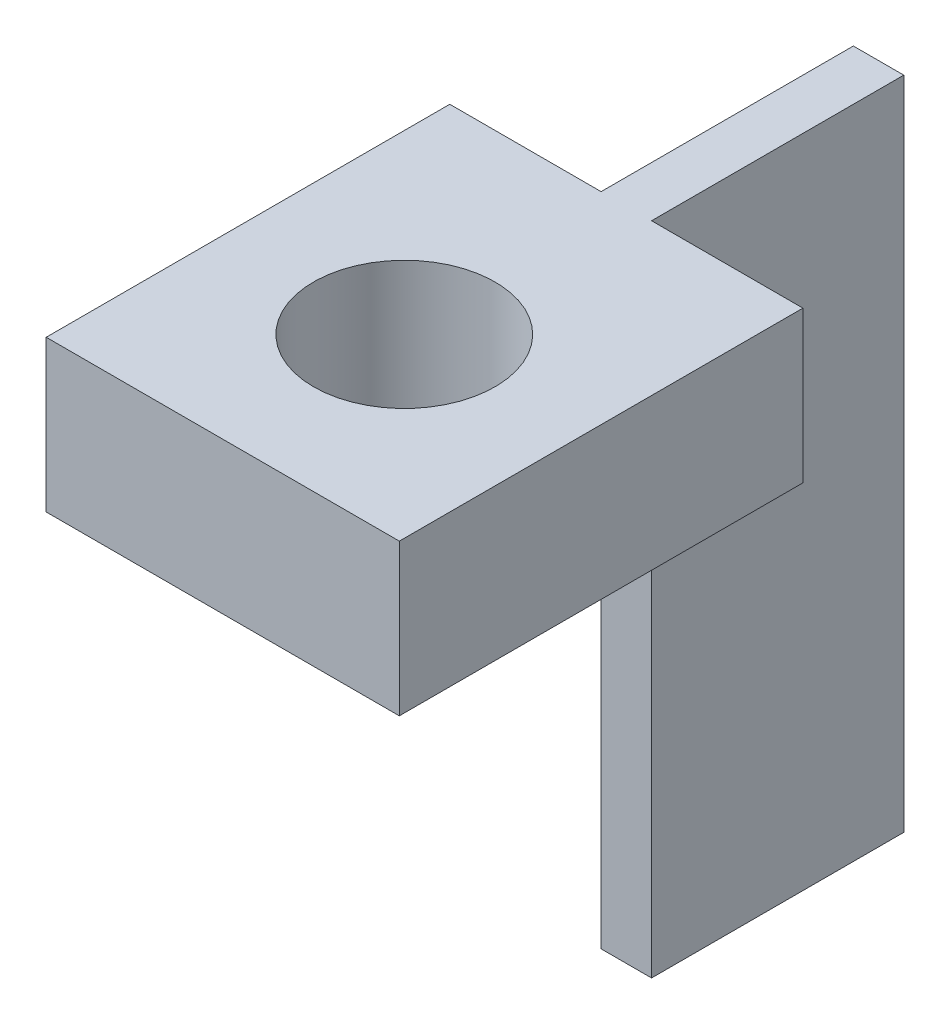
ISO-10303-21;
HEADER;
FILE_DESCRIPTION(('STEP AP214'),'2;1');
FILE_NAME('part.step','',(''),(''),'','','');
FILE_SCHEMA(('AUTOMOTIVE_DESIGN { 1 0 10303 214 1 1 1 1 }'));
ENDSEC;
DATA;
#1=APPLICATION_CONTEXT('core data for automotive mechanical design processes');
#2=APPLICATION_PROTOCOL_DEFINITION('international standard','automotive_design',2000,#1);
#3=PRODUCT_CONTEXT('',#1,'mechanical');
#4=PRODUCT('Part','Part','',(#3));
#5=PRODUCT_RELATED_PRODUCT_CATEGORY('part','',(#4));
#6=PRODUCT_DEFINITION_FORMATION('','',#4);
#7=PRODUCT_DEFINITION_CONTEXT('part definition',#1,'design');
#8=PRODUCT_DEFINITION('design','',#6,#7);
#9=PRODUCT_DEFINITION_SHAPE('','',#8);
#10=(LENGTH_UNIT() NAMED_UNIT(*) SI_UNIT(.MILLI.,.METRE.));
#11=(NAMED_UNIT(*) PLANE_ANGLE_UNIT() SI_UNIT($,.RADIAN.));
#12=(NAMED_UNIT(*) SI_UNIT($,.STERADIAN.) SOLID_ANGLE_UNIT());
#13=UNCERTAINTY_MEASURE_WITH_UNIT(LENGTH_MEASURE(1.E-05),#10,'distance_accuracy_value','');
#14=(GEOMETRIC_REPRESENTATION_CONTEXT(3) GLOBAL_UNCERTAINTY_ASSIGNED_CONTEXT((#13)) GLOBAL_UNIT_ASSIGNED_CONTEXT((#10,
#11,#12)) REPRESENTATION_CONTEXT('',''));
#15=CARTESIAN_POINT('',(0.,0.,0.));
#16=DIRECTION('',(0.,0.,1.));
#17=DIRECTION('',(1.,0.,0.));
#18=AXIS2_PLACEMENT_3D('',#15,#16,#17);
#19=CARTESIAN_POINT('',(0.5,0.,-5.));
#20=DIRECTION('',(0.,1.,0.));
#21=DIRECTION('',(0.,0.,1.));
#22=AXIS2_PLACEMENT_3D('',#19,#20,#21);
#23=PLANE('',#22);
#24=DIRECTION('',(0.,0.,-1.));
#25=VECTOR('',#24,1.);
#26=CARTESIAN_POINT('',(-0.5,0.,-5.));
#27=LINE('',#26,#25);
#28=CARTESIAN_POINT('',(-0.5,0.,0.));
#29=VERTEX_POINT('',#28);
#30=CARTESIAN_POINT('',(-0.5,0.,-5.));
#31=VERTEX_POINT('',#30);
#32=EDGE_CURVE('E160',#29,#31,#27,.T.);
#33=ORIENTED_EDGE('',*,*,#32,.T.);
#34=DIRECTION('',(-1.,0.,0.));
#35=VECTOR('',#34,1.);
#36=CARTESIAN_POINT('',(0.5,0.,-5.));
#37=LINE('',#36,#35);
#38=CARTESIAN_POINT('',(0.5,0.,-5.));
#39=VERTEX_POINT('',#38);
#40=EDGE_CURVE('E40',#39,#31,#37,.T.);
#41=ORIENTED_EDGE('',*,*,#40,.F.);
#42=DIRECTION('',(0.,0.,-1.));
#43=VECTOR('',#42,1.);
#44=CARTESIAN_POINT('',(0.5,0.,-5.));
#45=LINE('',#44,#43);
#46=CARTESIAN_POINT('',(0.5,0.,0.));
#47=VERTEX_POINT('',#46);
#48=EDGE_CURVE('E161',#47,#39,#45,.T.);
#49=ORIENTED_EDGE('',*,*,#48,.F.);
#50=DIRECTION('',(-1.,0.,0.));
#51=VECTOR('',#50,1.);
#52=CARTESIAN_POINT('',(0.5,0.,0.));
#53=LINE('',#52,#51);
#54=EDGE_CURVE('E166',#47,#29,#53,.T.);
#55=ORIENTED_EDGE('',*,*,#54,.T.);
#56=EDGE_LOOP('',(#33,#41,#49,#55));
#57=FACE_BOUND('',#56,.T.);
#58=ADVANCED_FACE('F33',(#57),#23,.F.);
#59=CARTESIAN_POINT('',(0.5,13.,-5.));
#60=DIRECTION('',(0.,0.,1.));
#61=DIRECTION('',(0.,-1.,0.));
#62=AXIS2_PLACEMENT_3D('',#59,#60,#61);
#63=PLANE('',#62);
#64=DIRECTION('',(0.,1.,0.));
#65=VECTOR('',#64,1.);
#66=CARTESIAN_POINT('',(-0.5,13.,-5.));
#67=LINE('',#66,#65);
#68=CARTESIAN_POINT('',(-0.5,13.,-5.));
#69=VERTEX_POINT('',#68);
#70=EDGE_CURVE('E169',#31,#69,#67,.T.);
#71=ORIENTED_EDGE('',*,*,#70,.T.);
#72=DIRECTION('',(-1.,0.,0.));
#73=VECTOR('',#72,1.);
#74=CARTESIAN_POINT('',(0.5,13.,-5.));
#75=LINE('',#74,#73);
#76=CARTESIAN_POINT('',(0.5,13.,-5.));
#77=VERTEX_POINT('',#76);
#78=EDGE_CURVE('E180',#77,#69,#75,.T.);
#79=ORIENTED_EDGE('',*,*,#78,.F.);
#80=DIRECTION('',(0.,1.,0.));
#81=VECTOR('',#80,1.);
#82=CARTESIAN_POINT('',(0.5,13.,-5.));
#83=LINE('',#82,#81);
#84=EDGE_CURVE('E80',#39,#77,#83,.T.);
#85=ORIENTED_EDGE('',*,*,#84,.F.);
#86=ORIENTED_EDGE('',*,*,#40,.T.);
#87=EDGE_LOOP('',(#71,#79,#85,#86));
#88=FACE_BOUND('',#87,.T.);
#89=ADVANCED_FACE('F182',(#88),#63,.F.);
#90=CARTESIAN_POINT('',(0.5,13.,8.));
#91=DIRECTION('',(0.,-1.,0.));
#92=DIRECTION('',(0.,0.,-1.));
#93=AXIS2_PLACEMENT_3D('',#90,#91,#92);
#94=PLANE('',#93);
#95=CARTESIAN_POINT('',(0.,13.,4.40159752744762));
#96=DIRECTION('',(0.,1.,0.));
#97=DIRECTION('',(0.,0.,1.));
#98=AXIS2_PLACEMENT_3D('',#95,#96,#97);
#99=CIRCLE('',#98,1.8);
#100=CARTESIAN_POINT('',(0.,13.,6.20159752744762));
#101=VERTEX_POINT('',#100);
#102=EDGE_CURVE('E322',#101,#101,#99,.T.);
#103=ORIENTED_EDGE('',*,*,#102,.F.);
#104=EDGE_LOOP('',(#103));
#105=FACE_BOUND('',#104,.T.);
#106=DIRECTION('',(0.,0.,1.));
#107=VECTOR('',#106,1.);
#108=CARTESIAN_POINT('',(-0.5,13.,8.));
#109=LINE('',#108,#107);
#110=CARTESIAN_POINT('',(-0.5,13.,0.));
#111=VERTEX_POINT('',#110);
#112=EDGE_CURVE('E131',#69,#111,#109,.T.);
#113=ORIENTED_EDGE('',*,*,#112,.T.);
#114=DIRECTION('',(1.,0.,0.));
#115=VECTOR('',#114,1.);
#116=CARTESIAN_POINT('',(-3.5,13.,0.));
#117=LINE('',#116,#115);
#118=CARTESIAN_POINT('',(-3.5,13.,0.));
#119=VERTEX_POINT('',#118);
#120=EDGE_CURVE('E114',#119,#111,#117,.T.);
#121=ORIENTED_EDGE('',*,*,#120,.F.);
#122=DIRECTION('',(0.,0.,-1.));
#123=VECTOR('',#122,1.);
#124=CARTESIAN_POINT('',(-3.5,13.,8.));
#125=LINE('',#124,#123);
#126=CARTESIAN_POINT('',(-3.5,13.,8.));
#127=VERTEX_POINT('',#126);
#128=EDGE_CURVE('E128',#127,#119,#125,.T.);
#129=ORIENTED_EDGE('',*,*,#128,.F.);
#130=DIRECTION('',(-1.,0.,0.));
#131=VECTOR('',#130,1.);
#132=CARTESIAN_POINT('',(0.5,13.,8.));
#133=LINE('',#132,#131);
#134=CARTESIAN_POINT('',(3.5,13.,8.));
#135=VERTEX_POINT('',#134);
#136=EDGE_CURVE('E178',#135,#127,#133,.T.);
#137=ORIENTED_EDGE('',*,*,#136,.F.);
#138=DIRECTION('',(0.,0.,1.));
#139=VECTOR('',#138,1.);
#140=CARTESIAN_POINT('',(3.5,13.,8.));
#141=LINE('',#140,#139);
#142=CARTESIAN_POINT('',(3.5,13.,0.));
#143=VERTEX_POINT('',#142);
#144=EDGE_CURVE('E122',#143,#135,#141,.T.);
#145=ORIENTED_EDGE('',*,*,#144,.F.);
#146=CARTESIAN_POINT('',(0.5,13.,0.));
#147=VERTEX_POINT('',#146);
#148=EDGE_CURVE('E132',#147,#143,#117,.T.);
#149=ORIENTED_EDGE('',*,*,#148,.F.);
#150=DIRECTION('',(0.,0.,1.));
#151=VECTOR('',#150,1.);
#152=CARTESIAN_POINT('',(0.5,13.,8.));
#153=LINE('',#152,#151);
#154=EDGE_CURVE('E47',#77,#147,#153,.T.);
#155=ORIENTED_EDGE('',*,*,#154,.F.);
#156=ORIENTED_EDGE('',*,*,#78,.T.);
#157=EDGE_LOOP('',(#113,#121,#129,#137,#145,#149,#155,#156));
#158=FACE_BOUND('',#157,.T.);
#159=ADVANCED_FACE('F127',(#105,#158),#94,.F.);
#160=CARTESIAN_POINT('',(0.5,10.,8.));
#161=DIRECTION('',(0.,0.,-1.));
#162=DIRECTION('',(-1.,0.,0.));
#163=AXIS2_PLACEMENT_3D('',#160,#161,#162);
#164=PLANE('',#163);
#165=ORIENTED_EDGE('',*,*,#136,.T.);
#166=DIRECTION('',(0.,-1.,0.));
#167=VECTOR('',#166,1.);
#168=CARTESIAN_POINT('',(-3.5,13.,8.));
#169=LINE('',#168,#167);
#170=CARTESIAN_POINT('',(-3.5,10.,8.));
#171=VERTEX_POINT('',#170);
#172=EDGE_CURVE('E137',#127,#171,#169,.T.);
#173=ORIENTED_EDGE('',*,*,#172,.T.);
#174=DIRECTION('',(-1.,0.,0.));
#175=VECTOR('',#174,1.);
#176=CARTESIAN_POINT('',(0.5,10.,8.));
#177=LINE('',#176,#175);
#178=CARTESIAN_POINT('',(3.5,10.,8.));
#179=VERTEX_POINT('',#178);
#180=EDGE_CURVE('E176',#179,#171,#177,.T.);
#181=ORIENTED_EDGE('',*,*,#180,.F.);
#182=DIRECTION('',(0.,-1.,0.));
#183=VECTOR('',#182,1.);
#184=CARTESIAN_POINT('',(3.5,13.,8.));
#185=LINE('',#184,#183);
#186=EDGE_CURVE('E154',#135,#179,#185,.T.);
#187=ORIENTED_EDGE('',*,*,#186,.F.);
#188=EDGE_LOOP('',(#165,#173,#181,#187));
#189=FACE_BOUND('',#188,.T.);
#190=ADVANCED_FACE('F204',(#189),#164,.F.);
#191=CARTESIAN_POINT('',(0.5,10.,0.));
#192=DIRECTION('',(0.,1.,0.));
#193=DIRECTION('',(0.,0.,1.));
#194=AXIS2_PLACEMENT_3D('',#191,#192,#193);
#195=PLANE('',#194);
#196=CARTESIAN_POINT('',(0.,10.,4.40159752744762));
#197=DIRECTION('',(0.,1.,0.));
#198=DIRECTION('',(0.,0.,1.));
#199=AXIS2_PLACEMENT_3D('',#196,#197,#198);
#200=CIRCLE('',#199,1.8);
#201=CARTESIAN_POINT('',(0.,10.,6.20159752744762));
#202=VERTEX_POINT('',#201);
#203=EDGE_CURVE('E143',#202,#202,#200,.T.);
#204=ORIENTED_EDGE('',*,*,#203,.T.);
#205=EDGE_LOOP('',(#204));
#206=FACE_BOUND('',#205,.T.);
#207=ORIENTED_EDGE('',*,*,#180,.T.);
#208=DIRECTION('',(0.,0.,-1.));
#209=VECTOR('',#208,1.);
#210=CARTESIAN_POINT('',(-3.5,10.,8.));
#211=LINE('',#210,#209);
#212=CARTESIAN_POINT('',(-3.5,10.,0.));
#213=VERTEX_POINT('',#212);
#214=EDGE_CURVE('E148',#171,#213,#211,.T.);
#215=ORIENTED_EDGE('',*,*,#214,.T.);
#216=DIRECTION('',(1.,0.,0.));
#217=VECTOR('',#216,1.);
#218=CARTESIAN_POINT('',(-3.5,10.,0.));
#219=LINE('',#218,#217);
#220=CARTESIAN_POINT('',(-0.5,10.,0.));
#221=VERTEX_POINT('',#220);
#222=EDGE_CURVE('E116',#213,#221,#219,.T.);
#223=ORIENTED_EDGE('',*,*,#222,.T.);
#224=DIRECTION('',(-1.,0.,0.));
#225=VECTOR('',#224,1.);
#226=CARTESIAN_POINT('',(0.5,10.,0.));
#227=LINE('',#226,#225);
#228=CARTESIAN_POINT('',(0.5,10.,0.));
#229=VERTEX_POINT('',#228);
#230=EDGE_CURVE('E174',#229,#221,#227,.T.);
#231=ORIENTED_EDGE('',*,*,#230,.F.);
#232=CARTESIAN_POINT('',(3.5,10.,0.));
#233=VERTEX_POINT('',#232);
#234=EDGE_CURVE('E150',#229,#233,#219,.T.);
#235=ORIENTED_EDGE('',*,*,#234,.T.);
#236=DIRECTION('',(0.,0.,1.));
#237=VECTOR('',#236,1.);
#238=CARTESIAN_POINT('',(3.5,10.,8.));
#239=LINE('',#238,#237);
#240=EDGE_CURVE('E138',#233,#179,#239,.T.);
#241=ORIENTED_EDGE('',*,*,#240,.T.);
#242=EDGE_LOOP('',(#207,#215,#223,#231,#235,#241));
#243=FACE_BOUND('',#242,.T.);
#244=ADVANCED_FACE('F191',(#206,#243),#195,.F.);
#245=CARTESIAN_POINT('',(0.5,0.,0.));
#246=DIRECTION('',(0.,0.,-1.));
#247=DIRECTION('',(-1.,0.,0.));
#248=AXIS2_PLACEMENT_3D('',#245,#246,#247);
#249=PLANE('',#248);
#250=DIRECTION('',(0.,-1.,0.));
#251=VECTOR('',#250,1.);
#252=CARTESIAN_POINT('',(-0.5,0.,0.));
#253=LINE('',#252,#251);
#254=EDGE_CURVE('E74',#221,#29,#253,.T.);
#255=ORIENTED_EDGE('',*,*,#254,.T.);
#256=ORIENTED_EDGE('',*,*,#54,.F.);
#257=DIRECTION('',(0.,-1.,0.));
#258=VECTOR('',#257,1.);
#259=CARTESIAN_POINT('',(0.5,0.,0.));
#260=LINE('',#259,#258);
#261=EDGE_CURVE('E54',#229,#47,#260,.T.);
#262=ORIENTED_EDGE('',*,*,#261,.F.);
#263=ORIENTED_EDGE('',*,*,#230,.T.);
#264=EDGE_LOOP('',(#255,#256,#262,#263));
#265=FACE_BOUND('',#264,.T.);
#266=ADVANCED_FACE('F189',(#265),#249,.F.);
#267=CARTESIAN_POINT('',(0.5,0.,0.));
#268=DIRECTION('',(-1.,0.,0.));
#269=DIRECTION('',(0.,0.,1.));
#270=AXIS2_PLACEMENT_3D('',#267,#268,#269);
#271=PLANE('',#270);
#272=ORIENTED_EDGE('',*,*,#154,.T.);
#273=DIRECTION('',(0.,-1.,0.));
#274=VECTOR('',#273,1.);
#275=CARTESIAN_POINT('',(0.5,0.,0.));
#276=LINE('',#275,#274);
#277=EDGE_CURVE('E153',#147,#229,#276,.T.);
#278=ORIENTED_EDGE('',*,*,#277,.T.);
#279=ORIENTED_EDGE('',*,*,#261,.T.);
#280=ORIENTED_EDGE('',*,*,#48,.T.);
#281=ORIENTED_EDGE('',*,*,#84,.T.);
#282=EDGE_LOOP('',(#272,#278,#279,#280,#281));
#283=FACE_BOUND('',#282,.T.);
#284=ADVANCED_FACE('F193',(#283),#271,.F.);
#285=CARTESIAN_POINT('',(-0.5,0.,0.));
#286=DIRECTION('',(-1.,0.,0.));
#287=DIRECTION('',(0.,0.,1.));
#288=AXIS2_PLACEMENT_3D('',#285,#286,#287);
#289=PLANE('',#288);
#290=DIRECTION('',(0.,-1.,0.));
#291=VECTOR('',#290,1.);
#292=CARTESIAN_POINT('',(-0.5,0.,0.));
#293=LINE('',#292,#291);
#294=EDGE_CURVE('E11',#111,#221,#293,.T.);
#295=ORIENTED_EDGE('',*,*,#294,.F.);
#296=ORIENTED_EDGE('',*,*,#112,.F.);
#297=ORIENTED_EDGE('',*,*,#70,.F.);
#298=ORIENTED_EDGE('',*,*,#32,.F.);
#299=ORIENTED_EDGE('',*,*,#254,.F.);
#300=EDGE_LOOP('',(#295,#296,#297,#298,#299));
#301=FACE_BOUND('',#300,.T.);
#302=ADVANCED_FACE('F187',(#301),#289,.T.);
#303=CARTESIAN_POINT('',(-3.5,13.,8.));
#304=DIRECTION('',(-1.,0.,0.));
#305=DIRECTION('',(0.,0.,1.));
#306=AXIS2_PLACEMENT_3D('',#303,#304,#305);
#307=PLANE('',#306);
#308=ORIENTED_EDGE('',*,*,#214,.F.);
#309=ORIENTED_EDGE('',*,*,#172,.F.);
#310=ORIENTED_EDGE('',*,*,#128,.T.);
#311=DIRECTION('',(0.,-1.,0.));
#312=VECTOR('',#311,1.);
#313=CARTESIAN_POINT('',(-3.5,13.,0.));
#314=LINE('',#313,#312);
#315=EDGE_CURVE('E111',#119,#213,#314,.T.);
#316=ORIENTED_EDGE('',*,*,#315,.T.);
#317=EDGE_LOOP('',(#308,#309,#310,#316));
#318=FACE_BOUND('',#317,.T.);
#319=ADVANCED_FACE('F135',(#318),#307,.T.);
#320=CARTESIAN_POINT('',(-3.5,13.,0.));
#321=DIRECTION('',(0.,0.,-1.));
#322=DIRECTION('',(0.,1.,0.));
#323=AXIS2_PLACEMENT_3D('',#320,#321,#322);
#324=PLANE('',#323);
#325=ORIENTED_EDGE('',*,*,#120,.T.);
#326=ORIENTED_EDGE('',*,*,#294,.T.);
#327=ORIENTED_EDGE('',*,*,#222,.F.);
#328=ORIENTED_EDGE('',*,*,#315,.F.);
#329=EDGE_LOOP('',(#325,#326,#327,#328));
#330=FACE_BOUND('',#329,.T.);
#331=ADVANCED_FACE('F113',(#330),#324,.T.);
#332=ORIENTED_EDGE('',*,*,#277,.F.);
#333=ORIENTED_EDGE('',*,*,#148,.T.);
#334=DIRECTION('',(0.,-1.,0.));
#335=VECTOR('',#334,1.);
#336=CARTESIAN_POINT('',(3.5,13.,0.));
#337=LINE('',#336,#335);
#338=EDGE_CURVE('E121',#143,#233,#337,.T.);
#339=ORIENTED_EDGE('',*,*,#338,.T.);
#340=ORIENTED_EDGE('',*,*,#234,.F.);
#341=EDGE_LOOP('',(#332,#333,#339,#340));
#342=FACE_BOUND('',#341,.T.);
#343=ADVANCED_FACE('F196',(#342),#324,.T.);
#344=CARTESIAN_POINT('',(3.5,13.,8.));
#345=DIRECTION('',(1.,0.,0.));
#346=DIRECTION('',(0.,0.,-1.));
#347=AXIS2_PLACEMENT_3D('',#344,#345,#346);
#348=PLANE('',#347);
#349=ORIENTED_EDGE('',*,*,#240,.F.);
#350=ORIENTED_EDGE('',*,*,#338,.F.);
#351=ORIENTED_EDGE('',*,*,#144,.T.);
#352=ORIENTED_EDGE('',*,*,#186,.T.);
#353=EDGE_LOOP('',(#349,#350,#351,#352));
#354=FACE_BOUND('',#353,.T.);
#355=ADVANCED_FACE('F201',(#354),#348,.T.);
#356=CARTESIAN_POINT('',(0.,13.,4.40159752744762));
#357=DIRECTION('',(0.,1.,0.));
#358=DIRECTION('',(0.,0.,1.));
#359=AXIS2_PLACEMENT_3D('',#356,#357,#358);
#360=CYLINDRICAL_SURFACE('',#359,1.8);
#361=ORIENTED_EDGE('',*,*,#102,.T.);
#362=EDGE_LOOP('',(#361));
#363=FACE_BOUND('',#362,.T.);
#364=ORIENTED_EDGE('',*,*,#203,.F.);
#365=EDGE_LOOP('',(#364));
#366=FACE_BOUND('',#365,.T.);
#367=ADVANCED_FACE('F247',(#363,#366),#360,.F.);
#368=CLOSED_SHELL('',(#58,#89,#159,#190,#244,#266,#284,#302,#319,#331,#343,#355,#367));
#369=MANIFOLD_SOLID_BREP('B2',#368);
#370=ADVANCED_BREP_SHAPE_REPRESENTATION('',(#18,#369),#14);
#371=SHAPE_DEFINITION_REPRESENTATION(#9,#370);
ENDSEC;
END-ISO-10303-21;
